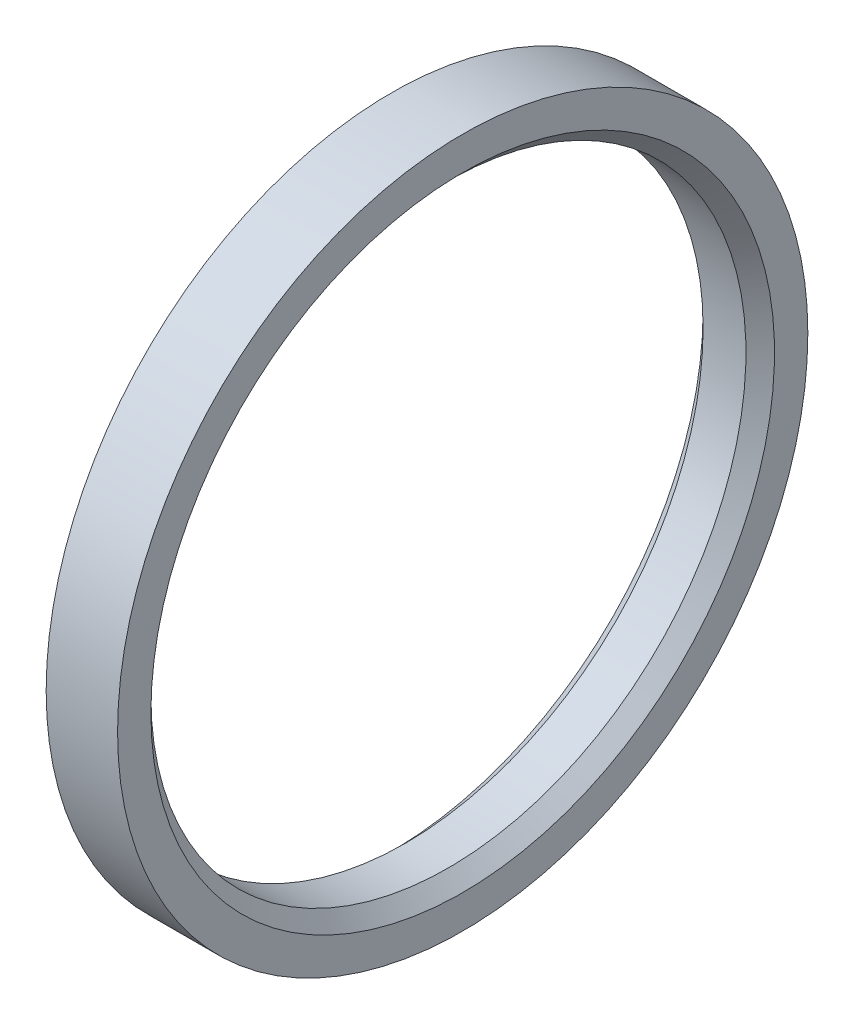
ISO-10303-21;
HEADER;
FILE_DESCRIPTION(('STEP AP214'),'2;1');
FILE_NAME('part.step','',(''),(''),'','','');
FILE_SCHEMA(('AUTOMOTIVE_DESIGN { 1 0 10303 214 1 1 1 1 }'));
ENDSEC;
DATA;
#1=APPLICATION_CONTEXT('core data for automotive mechanical design processes');
#2=APPLICATION_PROTOCOL_DEFINITION('international standard','automotive_design',2000,#1);
#3=PRODUCT_CONTEXT('',#1,'mechanical');
#4=PRODUCT('Part','Part','',(#3));
#5=PRODUCT_RELATED_PRODUCT_CATEGORY('part','',(#4));
#6=PRODUCT_DEFINITION_FORMATION('','',#4);
#7=PRODUCT_DEFINITION_CONTEXT('part definition',#1,'design');
#8=PRODUCT_DEFINITION('design','',#6,#7);
#9=PRODUCT_DEFINITION_SHAPE('','',#8);
#10=(LENGTH_UNIT() NAMED_UNIT(*) SI_UNIT(.MILLI.,.METRE.));
#11=(NAMED_UNIT(*) PLANE_ANGLE_UNIT() SI_UNIT($,.RADIAN.));
#12=(NAMED_UNIT(*) SI_UNIT($,.STERADIAN.) SOLID_ANGLE_UNIT());
#13=UNCERTAINTY_MEASURE_WITH_UNIT(LENGTH_MEASURE(1.E-05),#10,'distance_accuracy_value','');
#14=(GEOMETRIC_REPRESENTATION_CONTEXT(3) GLOBAL_UNCERTAINTY_ASSIGNED_CONTEXT((#13)) GLOBAL_UNIT_ASSIGNED_CONTEXT((#10,
#11,#12)) REPRESENTATION_CONTEXT('',''));
#15=CARTESIAN_POINT('',(0.,0.,0.));
#16=DIRECTION('',(0.,0.,1.));
#17=DIRECTION('',(1.,0.,0.));
#18=AXIS2_PLACEMENT_3D('',#15,#16,#17);
#19=CARTESIAN_POINT('',(0.,0.,0.));
#20=DIRECTION('',(-1.,0.,0.));
#21=DIRECTION('',(0.,0.,1.));
#22=AXIS2_PLACEMENT_3D('',#19,#20,#21);
#23=CYLINDRICAL_SURFACE('',#22,14.5);
#24=CARTESIAN_POINT('',(0.,0.,0.));
#25=DIRECTION('',(-1.,0.,0.));
#26=DIRECTION('',(0.,0.,1.));
#27=AXIS2_PLACEMENT_3D('',#24,#25,#26);
#28=CIRCLE('',#27,14.5);
#29=CARTESIAN_POINT('',(0.,0.,14.5));
#30=VERTEX_POINT('',#29);
#31=EDGE_CURVE('E52',#30,#30,#28,.T.);
#32=ORIENTED_EDGE('',*,*,#31,.F.);
#33=EDGE_LOOP('',(#32));
#34=FACE_BOUND('',#33,.T.);
#35=CARTESIAN_POINT('',(3.,0.,0.));
#36=DIRECTION('',(-1.,0.,0.));
#37=DIRECTION('',(0.,0.,1.));
#38=AXIS2_PLACEMENT_3D('',#35,#36,#37);
#39=CIRCLE('',#38,14.5);
#40=CARTESIAN_POINT('',(3.,0.,14.5));
#41=VERTEX_POINT('',#40);
#42=EDGE_CURVE('E55',#41,#41,#39,.T.);
#43=ORIENTED_EDGE('',*,*,#42,.T.);
#44=EDGE_LOOP('',(#43));
#45=FACE_BOUND('',#44,.T.);
#46=ADVANCED_FACE('F32',(#34,#45),#23,.T.);
#47=CARTESIAN_POINT('',(0.,14.5,0.));
#48=DIRECTION('',(1.,0.,0.));
#49=DIRECTION('',(0.,0.,-1.));
#50=AXIS2_PLACEMENT_3D('',#47,#48,#49);
#51=PLANE('',#50);
#52=CARTESIAN_POINT('',(0.,0.,0.));
#53=DIRECTION('',(1.,0.,0.));
#54=DIRECTION('',(0.,0.,-1.));
#55=AXIS2_PLACEMENT_3D('',#52,#53,#54);
#56=CIRCLE('',#55,13.1);
#57=CARTESIAN_POINT('',(0.,0.,-13.1));
#58=VERTEX_POINT('',#57);
#59=EDGE_CURVE('E10',#58,#58,#56,.T.);
#60=ORIENTED_EDGE('',*,*,#59,.T.);
#61=EDGE_LOOP('',(#60));
#62=FACE_BOUND('',#61,.T.);
#63=ORIENTED_EDGE('',*,*,#31,.T.);
#64=EDGE_LOOP('',(#63));
#65=FACE_BOUND('',#64,.T.);
#66=ADVANCED_FACE('F71',(#62,#65),#51,.F.);
#67=CARTESIAN_POINT('',(0.,0.,0.));
#68=DIRECTION('',(-1.,0.,0.));
#69=DIRECTION('',(0.,0.,1.));
#70=AXIS2_PLACEMENT_3D('',#67,#68,#69);
#71=CYLINDRICAL_SURFACE('',#70,12.5);
#72=CARTESIAN_POINT('',(2.4,0.,0.));
#73=DIRECTION('',(-1.,0.,0.));
#74=DIRECTION('',(0.,0.,1.));
#75=AXIS2_PLACEMENT_3D('',#72,#73,#74);
#76=CIRCLE('',#75,12.5);
#77=CARTESIAN_POINT('',(2.4,0.,12.5));
#78=VERTEX_POINT('',#77);
#79=EDGE_CURVE('E39',#78,#78,#76,.F.);
#80=ORIENTED_EDGE('',*,*,#79,.T.);
#81=EDGE_LOOP('',(#80));
#82=FACE_BOUND('',#81,.T.);
#83=CARTESIAN_POINT('',(0.599999999999998,0.,0.));
#84=DIRECTION('',(1.,0.,0.));
#85=DIRECTION('',(0.,0.,-1.));
#86=AXIS2_PLACEMENT_3D('',#83,#84,#85);
#87=CIRCLE('',#86,12.5);
#88=CARTESIAN_POINT('',(0.599999999999998,0.,-12.5));
#89=VERTEX_POINT('',#88);
#90=EDGE_CURVE('E43',#89,#89,#87,.F.);
#91=ORIENTED_EDGE('',*,*,#90,.T.);
#92=EDGE_LOOP('',(#91));
#93=FACE_BOUND('',#92,.T.);
#94=ADVANCED_FACE('F63',(#82,#93),#71,.F.);
#95=CARTESIAN_POINT('',(3.,12.5,0.));
#96=DIRECTION('',(-1.,0.,0.));
#97=DIRECTION('',(0.,0.,1.));
#98=AXIS2_PLACEMENT_3D('',#95,#96,#97);
#99=PLANE('',#98);
#100=CARTESIAN_POINT('',(3.,0.,0.));
#101=DIRECTION('',(-1.,0.,0.));
#102=DIRECTION('',(0.,0.,1.));
#103=AXIS2_PLACEMENT_3D('',#100,#101,#102);
#104=CIRCLE('',#103,13.1);
#105=CARTESIAN_POINT('',(3.,0.,13.1));
#106=VERTEX_POINT('',#105);
#107=EDGE_CURVE('E47',#106,#106,#104,.T.);
#108=ORIENTED_EDGE('',*,*,#107,.T.);
#109=EDGE_LOOP('',(#108));
#110=FACE_BOUND('',#109,.T.);
#111=ORIENTED_EDGE('',*,*,#42,.F.);
#112=EDGE_LOOP('',(#111));
#113=FACE_BOUND('',#112,.T.);
#114=ADVANCED_FACE('F60',(#110,#113),#99,.F.);
#115=CARTESIAN_POINT('',(3.,0.,0.));
#116=DIRECTION('',(1.,0.,0.));
#117=DIRECTION('',(0.,0.,-1.));
#118=AXIS2_PLACEMENT_3D('',#115,#116,#117);
#119=CONICAL_SURFACE('',#118,13.1,0.785398163397447);
#120=ORIENTED_EDGE('',*,*,#79,.F.);
#121=EDGE_LOOP('',(#120));
#122=FACE_BOUND('',#121,.T.);
#123=ORIENTED_EDGE('',*,*,#107,.F.);
#124=EDGE_LOOP('',(#123));
#125=FACE_BOUND('',#124,.T.);
#126=ADVANCED_FACE('F62',(#122,#125),#119,.F.);
#127=CARTESIAN_POINT('',(0.599999999999998,0.,0.));
#128=DIRECTION('',(-1.,0.,0.));
#129=DIRECTION('',(0.,0.,1.));
#130=AXIS2_PLACEMENT_3D('',#127,#128,#129);
#131=CONICAL_SURFACE('',#130,12.5,0.78539816339745);
#132=ORIENTED_EDGE('',*,*,#59,.F.);
#133=EDGE_LOOP('',(#132));
#134=FACE_BOUND('',#133,.T.);
#135=ORIENTED_EDGE('',*,*,#90,.F.);
#136=EDGE_LOOP('',(#135));
#137=FACE_BOUND('',#136,.T.);
#138=ADVANCED_FACE('F34',(#134,#137),#131,.F.);
#139=CLOSED_SHELL('',(#46,#66,#94,#114,#126,#138));
#140=MANIFOLD_SOLID_BREP('B2',#139);
#141=ADVANCED_BREP_SHAPE_REPRESENTATION('',(#18,#140),#14);
#142=SHAPE_DEFINITION_REPRESENTATION(#9,#141);
ENDSEC;
END-ISO-10303-21;
